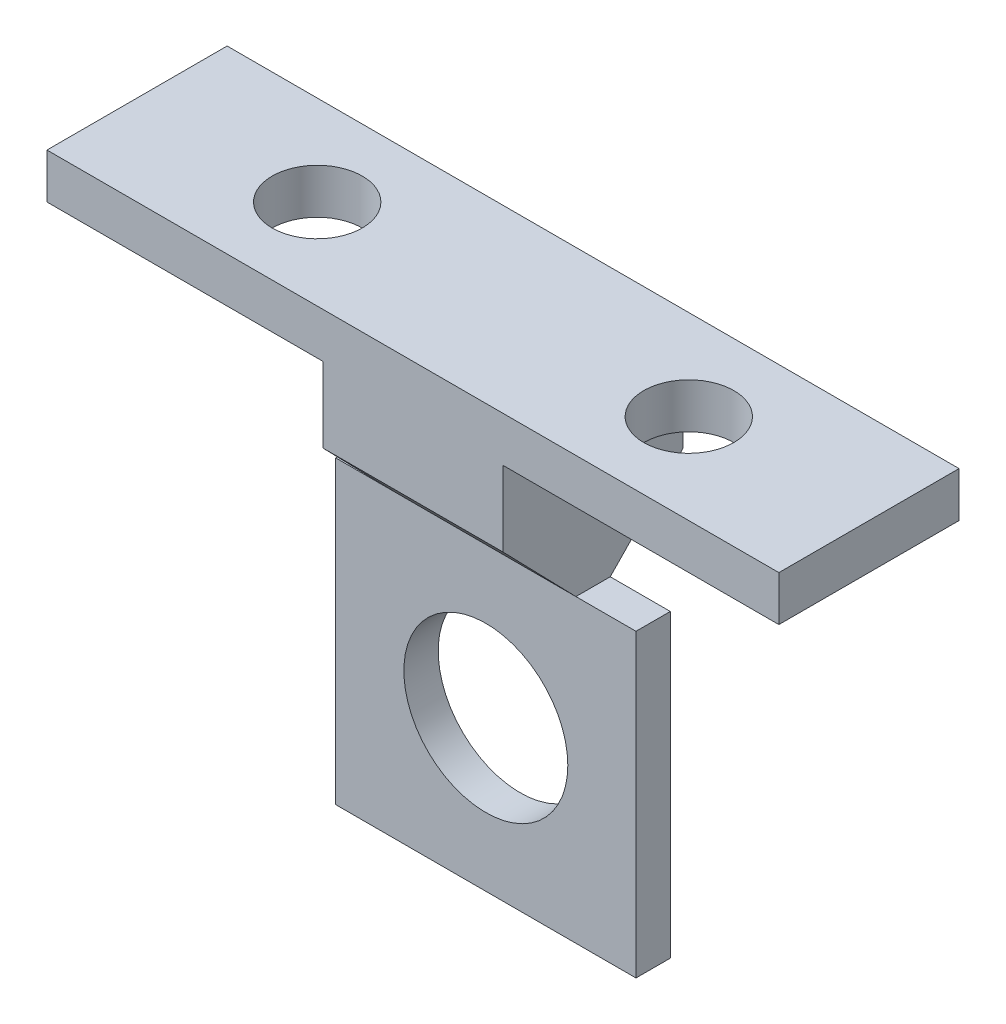
ISO-10303-21;
HEADER;
FILE_DESCRIPTION(('STEP AP214'),'2;1');
FILE_NAME('part.step','',(''),(''),'','','');
FILE_SCHEMA(('AUTOMOTIVE_DESIGN { 1 0 10303 214 1 1 1 1 }'));
ENDSEC;
DATA;
#1=APPLICATION_CONTEXT('core data for automotive mechanical design processes');
#2=APPLICATION_PROTOCOL_DEFINITION('international standard','automotive_design',2000,#1);
#3=PRODUCT_CONTEXT('',#1,'mechanical');
#4=PRODUCT('Part','Part','',(#3));
#5=PRODUCT_RELATED_PRODUCT_CATEGORY('part','',(#4));
#6=PRODUCT_DEFINITION_FORMATION('','',#4);
#7=PRODUCT_DEFINITION_CONTEXT('part definition',#1,'design');
#8=PRODUCT_DEFINITION('design','',#6,#7);
#9=PRODUCT_DEFINITION_SHAPE('','',#8);
#10=(LENGTH_UNIT() NAMED_UNIT(*) SI_UNIT(.MILLI.,.METRE.));
#11=(NAMED_UNIT(*) PLANE_ANGLE_UNIT() SI_UNIT($,.RADIAN.));
#12=(NAMED_UNIT(*) SI_UNIT($,.STERADIAN.) SOLID_ANGLE_UNIT());
#13=UNCERTAINTY_MEASURE_WITH_UNIT(LENGTH_MEASURE(1.E-05),#10,'distance_accuracy_value','');
#14=(GEOMETRIC_REPRESENTATION_CONTEXT(3) GLOBAL_UNCERTAINTY_ASSIGNED_CONTEXT((#13)) GLOBAL_UNIT_ASSIGNED_CONTEXT((#10,
#11,#12)) REPRESENTATION_CONTEXT('',''));
#15=CARTESIAN_POINT('',(0.,0.,0.));
#16=DIRECTION('',(0.,0.,1.));
#17=DIRECTION('',(1.,0.,0.));
#18=AXIS2_PLACEMENT_3D('',#15,#16,#17);
#19=CARTESIAN_POINT('',(-33.0408964823714,13.4768329024308,2.286));
#20=DIRECTION('',(0.,1.,0.));
#21=DIRECTION('',(0.,0.,1.));
#22=AXIS2_PLACEMENT_3D('',#19,#20,#21);
#23=PLANE('',#22);
#24=CARTESIAN_POINT('',(-26.6665278123715,13.4768329024308,1.143));
#25=DIRECTION('',(0.,1.,0.));
#26=DIRECTION('',(0.,0.,1.));
#27=AXIS2_PLACEMENT_3D('',#24,#25,#26);
#28=CIRCLE('',#27,2.99999999999999);
#29=CARTESIAN_POINT('',(-26.6665278123715,13.4768329024308,4.14299999999999));
#30=VERTEX_POINT('',#29);
#31=EDGE_CURVE('E302',#30,#30,#28,.F.);
#32=ORIENTED_EDGE('',*,*,#31,.F.);
#33=EDGE_LOOP('',(#32));
#34=FACE_BOUND('',#33,.T.);
#35=DIRECTION('',(0.,0.,-1.));
#36=VECTOR('',#35,1.);
#37=CARTESIAN_POINT('',(-33.0408964823714,13.4768329024308,2.286));
#38=LINE('',#37,#36);
#39=CARTESIAN_POINT('',(-33.0408964823714,13.4768329024311,7.143));
#40=VERTEX_POINT('',#39);
#41=CARTESIAN_POINT('',(-33.0408964823714,13.4768329024311,-4.857));
#42=VERTEX_POINT('',#41);
#43=EDGE_CURVE('E60',#40,#42,#38,.T.);
#44=ORIENTED_EDGE('',*,*,#43,.T.);
#45=DIRECTION('',(-1.,0.,0.));
#46=VECTOR('',#45,1.);
#47=CARTESIAN_POINT('',(-2.29721093551843,13.4768329024311,-4.857));
#48=LINE('',#47,#46);
#49=CARTESIAN_POINT('',(-14.6665278123714,13.4768329024311,-4.857));
#50=VERTEX_POINT('',#49);
#51=EDGE_CURVE('E202',#50,#42,#48,.T.);
#52=ORIENTED_EDGE('',*,*,#51,.F.);
#53=DIRECTION('',(0.,0.,-1.));
#54=VECTOR('',#53,1.);
#55=CARTESIAN_POINT('',(-14.6665278123714,13.4768329024308,2.286));
#56=LINE('',#55,#54);
#57=CARTESIAN_POINT('',(-14.6665278123714,13.4768329024311,7.143));
#58=VERTEX_POINT('',#57);
#59=EDGE_CURVE('E229',#58,#50,#56,.T.);
#60=ORIENTED_EDGE('',*,*,#59,.F.);
#61=DIRECTION('',(-1.,0.,0.));
#62=VECTOR('',#61,1.);
#63=CARTESIAN_POINT('',(-2.29721093551843,13.4768329024311,7.143));
#64=LINE('',#63,#62);
#65=EDGE_CURVE('E199',#58,#40,#64,.T.);
#66=ORIENTED_EDGE('',*,*,#65,.T.);
#67=EDGE_LOOP('',(#44,#52,#60,#66));
#68=FACE_BOUND('',#67,.T.);
#69=ADVANCED_FACE('F37',(#34,#68),#23,.F.);
#70=CARTESIAN_POINT('',(-51.4152651523715,13.4768329024308,1.143));
#71=DIRECTION('',(0.,1.,0.));
#72=DIRECTION('',(0.,0.,1.));
#73=AXIS2_PLACEMENT_3D('',#70,#71,#72);
#74=CIRCLE('',#73,3.);
#75=CARTESIAN_POINT('',(-51.4152651523715,13.4768329024308,4.143));
#76=VERTEX_POINT('',#75);
#77=EDGE_CURVE('E307',#76,#76,#74,.F.);
#78=ORIENTED_EDGE('',*,*,#77,.F.);
#79=EDGE_LOOP('',(#78));
#80=FACE_BOUND('',#79,.T.);
#81=DIRECTION('',(0.,0.,-1.));
#82=VECTOR('',#81,1.);
#83=CARTESIAN_POINT('',(-45.0408964823714,13.4768329024308,2.286));
#84=LINE('',#83,#82);
#85=CARTESIAN_POINT('',(-45.0408964823714,13.4768329024311,7.143));
#86=VERTEX_POINT('',#85);
#87=CARTESIAN_POINT('',(-45.0408964823714,13.4768329024311,-4.857));
#88=VERTEX_POINT('',#87);
#89=EDGE_CURVE('E46',#86,#88,#84,.T.);
#90=ORIENTED_EDGE('',*,*,#89,.F.);
#91=CARTESIAN_POINT('',(-63.4152651523715,13.4768329024311,7.143));
#92=VERTEX_POINT('',#91);
#93=EDGE_CURVE('E201',#86,#92,#64,.T.);
#94=ORIENTED_EDGE('',*,*,#93,.T.);
#95=DIRECTION('',(0.,0.,-1.));
#96=VECTOR('',#95,1.);
#97=CARTESIAN_POINT('',(-63.4152651523715,13.4768329024308,2.286));
#98=LINE('',#97,#96);
#99=CARTESIAN_POINT('',(-63.4152651523715,13.4768329024311,-4.857));
#100=VERTEX_POINT('',#99);
#101=EDGE_CURVE('E11',#92,#100,#98,.T.);
#102=ORIENTED_EDGE('',*,*,#101,.T.);
#103=EDGE_CURVE('E193',#88,#100,#48,.T.);
#104=ORIENTED_EDGE('',*,*,#103,.F.);
#105=EDGE_LOOP('',(#90,#94,#102,#104));
#106=FACE_BOUND('',#105,.T.);
#107=ADVANCED_FACE('F338',(#80,#106),#23,.F.);
#108=CARTESIAN_POINT('',(-63.4152651523714,16.4768329024308,2.286));
#109=DIRECTION('',(1.,0.,0.));
#110=DIRECTION('',(0.,1.,0.));
#111=AXIS2_PLACEMENT_3D('',#108,#109,#110);
#112=PLANE('',#111);
#113=DIRECTION('',(0.,0.,-1.));
#114=VECTOR('',#113,1.);
#115=CARTESIAN_POINT('',(-63.4152651523714,16.4768329024308,2.286));
#116=LINE('',#115,#114);
#117=CARTESIAN_POINT('',(-63.4152651523715,16.4768329024311,7.143));
#118=VERTEX_POINT('',#117);
#119=CARTESIAN_POINT('',(-63.4152651523715,16.4768329024311,-4.857));
#120=VERTEX_POINT('',#119);
#121=EDGE_CURVE('E216',#118,#120,#116,.T.);
#122=ORIENTED_EDGE('',*,*,#121,.T.);
#123=DIRECTION('',(0.,-1.,0.));
#124=VECTOR('',#123,1.);
#125=CARTESIAN_POINT('',(-63.4152651523715,16.4768329024311,-4.857));
#126=LINE('',#125,#124);
#127=EDGE_CURVE('E179',#120,#100,#126,.T.);
#128=ORIENTED_EDGE('',*,*,#127,.T.);
#129=ORIENTED_EDGE('',*,*,#101,.F.);
#130=DIRECTION('',(0.,1.,0.));
#131=VECTOR('',#130,1.);
#132=CARTESIAN_POINT('',(-63.4152651523715,16.4768329024311,7.143));
#133=LINE('',#132,#131);
#134=EDGE_CURVE('E190',#92,#118,#133,.T.);
#135=ORIENTED_EDGE('',*,*,#134,.T.);
#136=EDGE_LOOP('',(#122,#128,#129,#135));
#137=FACE_BOUND('',#136,.T.);
#138=ADVANCED_FACE('F39',(#137),#112,.F.);
#139=CARTESIAN_POINT('',(-45.0408964823714,8.47683290243078,2.286));
#140=DIRECTION('',(1.,0.,0.));
#141=DIRECTION('',(0.,0.,-1.));
#142=AXIS2_PLACEMENT_3D('',#139,#140,#141);
#143=PLANE('',#142);
#144=ORIENTED_EDGE('',*,*,#89,.T.);
#145=DIRECTION('',(0.,-1.,0.));
#146=VECTOR('',#145,1.);
#147=CARTESIAN_POINT('',(-45.0408964823714,13.4768329024311,-4.857));
#148=LINE('',#147,#146);
#149=CARTESIAN_POINT('',(-45.0408964823714,8.47683290243107,-4.857));
#150=VERTEX_POINT('',#149);
#151=EDGE_CURVE('E165',#88,#150,#148,.T.);
#152=ORIENTED_EDGE('',*,*,#151,.T.);
#153=DIRECTION('',(0.,-0.71728962347272,0.696775140241358));
#154=VECTOR('',#153,1.);
#155=CARTESIAN_POINT('',(-45.0408964823714,8.47683290243107,-4.857));
#156=LINE('',#155,#154);
#157=CARTESIAN_POINT('',(-45.0408964823714,3.47683290243076,0.));
#158=VERTEX_POINT('',#157);
#159=EDGE_CURVE('E297',#150,#158,#156,.T.);
#160=ORIENTED_EDGE('',*,*,#159,.T.);
#161=DIRECTION('',(0.,0.,-1.));
#162=VECTOR('',#161,1.);
#163=CARTESIAN_POINT('',(-45.0408964823714,3.47683290243078,2.286));
#164=LINE('',#163,#162);
#165=CARTESIAN_POINT('',(-45.0408964823714,3.47683290243078,2.286));
#166=VERTEX_POINT('',#165);
#167=EDGE_CURVE('E246',#166,#158,#164,.T.);
#168=ORIENTED_EDGE('',*,*,#167,.F.);
#169=DIRECTION('',(0.,0.71728962347272,0.696775140241358));
#170=VECTOR('',#169,1.);
#171=CARTESIAN_POINT('',(-45.0408964823714,3.47683290243076,2.286));
#172=LINE('',#171,#170);
#173=CARTESIAN_POINT('',(-45.0408964823714,8.47683290243107,7.143));
#174=VERTEX_POINT('',#173);
#175=EDGE_CURVE('E173',#166,#174,#172,.T.);
#176=ORIENTED_EDGE('',*,*,#175,.T.);
#177=DIRECTION('',(0.,1.,0.));
#178=VECTOR('',#177,1.);
#179=CARTESIAN_POINT('',(-45.0408964823714,8.47683290243107,7.143));
#180=LINE('',#179,#178);
#181=EDGE_CURVE('E147',#174,#86,#180,.T.);
#182=ORIENTED_EDGE('',*,*,#181,.T.);
#183=EDGE_LOOP('',(#144,#152,#160,#168,#176,#182));
#184=FACE_BOUND('',#183,.T.);
#185=ADVANCED_FACE('F296',(#184),#143,.F.);
#186=CARTESIAN_POINT('',(-45.0408964823714,3.47683290243078,2.286));
#187=DIRECTION('',(0.,-1.,0.));
#188=DIRECTION('',(1.,0.,0.));
#189=AXIS2_PLACEMENT_3D('',#186,#187,#188);
#190=PLANE('',#189);
#191=DIRECTION('',(-1.,0.,0.));
#192=VECTOR('',#191,1.);
#193=CARTESIAN_POINT('',(-45.0408964823714,3.47683290243078,0.));
#194=LINE('',#193,#192);
#195=CARTESIAN_POINT('',(-49.0408964823714,3.47683290243077,0.));
#196=VERTEX_POINT('',#195);
#197=EDGE_CURVE('E187',#158,#196,#194,.T.);
#198=ORIENTED_EDGE('',*,*,#197,.T.);
#199=DIRECTION('',(0.,0.,-1.));
#200=VECTOR('',#199,1.);
#201=CARTESIAN_POINT('',(-49.0408964823714,3.47683290243077,2.286));
#202=LINE('',#201,#200);
#203=CARTESIAN_POINT('',(-49.0408964823714,3.47683290243077,2.286));
#204=VERTEX_POINT('',#203);
#205=EDGE_CURVE('E243',#204,#196,#202,.T.);
#206=ORIENTED_EDGE('',*,*,#205,.F.);
#207=DIRECTION('',(-1.,0.,0.));
#208=VECTOR('',#207,1.);
#209=CARTESIAN_POINT('',(-45.0408964823714,3.47683290243078,2.286));
#210=LINE('',#209,#208);
#211=EDGE_CURVE('E205',#166,#204,#210,.T.);
#212=ORIENTED_EDGE('',*,*,#211,.F.);
#213=ORIENTED_EDGE('',*,*,#167,.T.);
#214=EDGE_LOOP('',(#198,#206,#212,#213));
#215=FACE_BOUND('',#214,.T.);
#216=ADVANCED_FACE('F253',(#215),#190,.F.);
#217=CARTESIAN_POINT('',(-49.0408964823714,3.47683290243077,2.286));
#218=DIRECTION('',(1.,0.,0.));
#219=DIRECTION('',(0.,1.,0.));
#220=AXIS2_PLACEMENT_3D('',#217,#218,#219);
#221=PLANE('',#220);
#222=DIRECTION('',(0.,-1.,0.));
#223=VECTOR('',#222,1.);
#224=CARTESIAN_POINT('',(-49.0408964823714,3.47683290243077,0.));
#225=LINE('',#224,#223);
#226=CARTESIAN_POINT('',(-49.0408964823714,-16.5231670975692,0.));
#227=VERTEX_POINT('',#226);
#228=EDGE_CURVE('E218',#196,#227,#225,.T.);
#229=ORIENTED_EDGE('',*,*,#228,.T.);
#230=DIRECTION('',(0.,0.,-1.));
#231=VECTOR('',#230,1.);
#232=CARTESIAN_POINT('',(-49.0408964823714,-16.5231670975692,2.286));
#233=LINE('',#232,#231);
#234=CARTESIAN_POINT('',(-49.0408964823714,-16.5231670975692,2.286));
#235=VERTEX_POINT('',#234);
#236=EDGE_CURVE('E240',#235,#227,#233,.T.);
#237=ORIENTED_EDGE('',*,*,#236,.F.);
#238=DIRECTION('',(0.,-1.,0.));
#239=VECTOR('',#238,1.);
#240=CARTESIAN_POINT('',(-49.0408964823714,3.47683290243077,2.286));
#241=LINE('',#240,#239);
#242=EDGE_CURVE('E207',#204,#235,#241,.T.);
#243=ORIENTED_EDGE('',*,*,#242,.F.);
#244=ORIENTED_EDGE('',*,*,#205,.T.);
#245=EDGE_LOOP('',(#229,#237,#243,#244));
#246=FACE_BOUND('',#245,.T.);
#247=ADVANCED_FACE('F264',(#246),#221,.F.);
#248=CARTESIAN_POINT('',(-49.0408964823714,-16.5231670975692,2.286));
#249=DIRECTION('',(0.,1.,0.));
#250=DIRECTION('',(-1.,0.,0.));
#251=AXIS2_PLACEMENT_3D('',#248,#249,#250);
#252=PLANE('',#251);
#253=DIRECTION('',(1.,0.,0.));
#254=VECTOR('',#253,1.);
#255=CARTESIAN_POINT('',(-49.0408964823714,-16.5231670975692,0.));
#256=LINE('',#255,#254);
#257=CARTESIAN_POINT('',(-29.0408964823714,-16.5231670975692,0.));
#258=VERTEX_POINT('',#257);
#259=EDGE_CURVE('E220',#227,#258,#256,.T.);
#260=ORIENTED_EDGE('',*,*,#259,.T.);
#261=DIRECTION('',(0.,0.,-1.));
#262=VECTOR('',#261,1.);
#263=CARTESIAN_POINT('',(-29.0408964823714,-16.5231670975692,2.286));
#264=LINE('',#263,#262);
#265=CARTESIAN_POINT('',(-29.0408964823714,-16.5231670975692,2.286));
#266=VERTEX_POINT('',#265);
#267=EDGE_CURVE('E237',#266,#258,#264,.T.);
#268=ORIENTED_EDGE('',*,*,#267,.F.);
#269=DIRECTION('',(1.,0.,0.));
#270=VECTOR('',#269,1.);
#271=CARTESIAN_POINT('',(-49.0408964823714,-16.5231670975692,2.286));
#272=LINE('',#271,#270);
#273=EDGE_CURVE('E210',#235,#266,#272,.T.);
#274=ORIENTED_EDGE('',*,*,#273,.F.);
#275=ORIENTED_EDGE('',*,*,#236,.T.);
#276=EDGE_LOOP('',(#260,#268,#274,#275));
#277=FACE_BOUND('',#276,.T.);
#278=ADVANCED_FACE('F268',(#277),#252,.F.);
#279=CARTESIAN_POINT('',(-29.0408964823714,3.47683290243078,2.286));
#280=DIRECTION('',(-1.,0.,0.));
#281=DIRECTION('',(0.,0.,1.));
#282=AXIS2_PLACEMENT_3D('',#279,#280,#281);
#283=PLANE('',#282);
#284=DIRECTION('',(0.,1.,0.));
#285=VECTOR('',#284,1.);
#286=CARTESIAN_POINT('',(-29.0408964823714,3.47683290243078,0.));
#287=LINE('',#286,#285);
#288=CARTESIAN_POINT('',(-29.0408964823714,3.47683290243078,0.));
#289=VERTEX_POINT('',#288);
#290=EDGE_CURVE('E222',#258,#289,#287,.T.);
#291=ORIENTED_EDGE('',*,*,#290,.T.);
#292=DIRECTION('',(0.,0.,-1.));
#293=VECTOR('',#292,1.);
#294=CARTESIAN_POINT('',(-29.0408964823714,3.47683290243078,2.286));
#295=LINE('',#294,#293);
#296=CARTESIAN_POINT('',(-29.0408964823714,3.47683290243078,2.286));
#297=VERTEX_POINT('',#296);
#298=EDGE_CURVE('E234',#297,#289,#295,.T.);
#299=ORIENTED_EDGE('',*,*,#298,.F.);
#300=DIRECTION('',(0.,1.,0.));
#301=VECTOR('',#300,1.);
#302=CARTESIAN_POINT('',(-29.0408964823714,3.47683290243078,2.286));
#303=LINE('',#302,#301);
#304=EDGE_CURVE('E212',#266,#297,#303,.T.);
#305=ORIENTED_EDGE('',*,*,#304,.F.);
#306=ORIENTED_EDGE('',*,*,#267,.T.);
#307=EDGE_LOOP('',(#291,#299,#305,#306));
#308=FACE_BOUND('',#307,.T.);
#309=ADVANCED_FACE('F352',(#308),#283,.F.);
#310=CARTESIAN_POINT('',(-29.0408964823714,3.47683290243078,2.286));
#311=DIRECTION('',(0.,-1.,0.));
#312=DIRECTION('',(1.,0.,0.));
#313=AXIS2_PLACEMENT_3D('',#310,#311,#312);
#314=PLANE('',#313);
#315=DIRECTION('',(-1.,0.,0.));
#316=VECTOR('',#315,1.);
#317=CARTESIAN_POINT('',(-29.0408964823714,3.47683290243078,0.));
#318=LINE('',#317,#316);
#319=CARTESIAN_POINT('',(-33.0408964823714,3.47683290243076,0.));
#320=VERTEX_POINT('',#319);
#321=EDGE_CURVE('E208',#289,#320,#318,.T.);
#322=ORIENTED_EDGE('',*,*,#321,.T.);
#323=DIRECTION('',(0.,0.,-1.));
#324=VECTOR('',#323,1.);
#325=CARTESIAN_POINT('',(-33.0408964823714,3.47683290243078,2.286));
#326=LINE('',#325,#324);
#327=CARTESIAN_POINT('',(-33.0408964823714,3.47683290243078,2.286));
#328=VERTEX_POINT('',#327);
#329=EDGE_CURVE('E232',#328,#320,#326,.T.);
#330=ORIENTED_EDGE('',*,*,#329,.F.);
#331=DIRECTION('',(-1.,0.,0.));
#332=VECTOR('',#331,1.);
#333=CARTESIAN_POINT('',(-29.0408964823714,3.47683290243078,2.286));
#334=LINE('',#333,#332);
#335=EDGE_CURVE('E214',#297,#328,#334,.T.);
#336=ORIENTED_EDGE('',*,*,#335,.F.);
#337=ORIENTED_EDGE('',*,*,#298,.T.);
#338=EDGE_LOOP('',(#322,#330,#336,#337));
#339=FACE_BOUND('',#338,.T.);
#340=ADVANCED_FACE('F277',(#339),#314,.F.);
#341=CARTESIAN_POINT('',(-33.0408964823714,13.4768329024308,2.286));
#342=DIRECTION('',(-1.,0.,0.));
#343=DIRECTION('',(0.,0.,1.));
#344=AXIS2_PLACEMENT_3D('',#341,#342,#343);
#345=PLANE('',#344);
#346=ORIENTED_EDGE('',*,*,#329,.T.);
#347=DIRECTION('',(0.,0.71728962347272,-0.696775140241358));
#348=VECTOR('',#347,1.);
#349=CARTESIAN_POINT('',(-33.0408964823714,8.47683290243107,-4.857));
#350=LINE('',#349,#348);
#351=CARTESIAN_POINT('',(-33.0408964823714,8.47683290243107,-4.857));
#352=VERTEX_POINT('',#351);
#353=EDGE_CURVE('E158',#320,#352,#350,.T.);
#354=ORIENTED_EDGE('',*,*,#353,.T.);
#355=DIRECTION('',(0.,1.,0.));
#356=VECTOR('',#355,1.);
#357=CARTESIAN_POINT('',(-33.0408964823714,13.4768329024311,-4.857));
#358=LINE('',#357,#356);
#359=EDGE_CURVE('E151',#352,#42,#358,.T.);
#360=ORIENTED_EDGE('',*,*,#359,.T.);
#361=ORIENTED_EDGE('',*,*,#43,.F.);
#362=DIRECTION('',(0.,-1.,0.));
#363=VECTOR('',#362,1.);
#364=CARTESIAN_POINT('',(-33.0408964823714,8.47683290243107,7.143));
#365=LINE('',#364,#363);
#366=CARTESIAN_POINT('',(-33.0408964823714,8.47683290243107,7.143));
#367=VERTEX_POINT('',#366);
#368=EDGE_CURVE('E145',#40,#367,#365,.T.);
#369=ORIENTED_EDGE('',*,*,#368,.T.);
#370=DIRECTION('',(0.,-0.71728962347272,-0.696775140241358));
#371=VECTOR('',#370,1.);
#372=CARTESIAN_POINT('',(-33.0408964823714,3.47683290243076,2.286));
#373=LINE('',#372,#371);
#374=EDGE_CURVE('E155',#367,#328,#373,.T.);
#375=ORIENTED_EDGE('',*,*,#374,.T.);
#376=EDGE_LOOP('',(#346,#354,#360,#361,#369,#375));
#377=FACE_BOUND('',#376,.T.);
#378=ADVANCED_FACE('F160',(#377),#345,.F.);
#379=CARTESIAN_POINT('',(-14.6665278123714,16.4768329024308,2.286));
#380=DIRECTION('',(-1.,0.,0.));
#381=DIRECTION('',(0.,-1.,0.));
#382=AXIS2_PLACEMENT_3D('',#379,#380,#381);
#383=PLANE('',#382);
#384=ORIENTED_EDGE('',*,*,#59,.T.);
#385=DIRECTION('',(0.,1.,0.));
#386=VECTOR('',#385,1.);
#387=CARTESIAN_POINT('',(-14.6665278123714,16.476832902431,-4.857));
#388=LINE('',#387,#386);
#389=CARTESIAN_POINT('',(-14.6665278123714,16.4768329024311,-4.857));
#390=VERTEX_POINT('',#389);
#391=EDGE_CURVE('E183',#50,#390,#388,.T.);
#392=ORIENTED_EDGE('',*,*,#391,.T.);
#393=DIRECTION('',(0.,0.,-1.));
#394=VECTOR('',#393,1.);
#395=CARTESIAN_POINT('',(-14.6665278123714,16.4768329024308,2.286));
#396=LINE('',#395,#394);
#397=CARTESIAN_POINT('',(-14.6665278123714,16.4768329024311,7.143));
#398=VERTEX_POINT('',#397);
#399=EDGE_CURVE('E227',#398,#390,#396,.T.);
#400=ORIENTED_EDGE('',*,*,#399,.F.);
#401=DIRECTION('',(0.,-1.,0.));
#402=VECTOR('',#401,1.);
#403=CARTESIAN_POINT('',(-14.6665278123714,16.476832902431,7.143));
#404=LINE('',#403,#402);
#405=EDGE_CURVE('E180',#398,#58,#404,.T.);
#406=ORIENTED_EDGE('',*,*,#405,.T.);
#407=EDGE_LOOP('',(#384,#392,#400,#406));
#408=FACE_BOUND('',#407,.T.);
#409=ADVANCED_FACE('F319',(#408),#383,.F.);
#410=CARTESIAN_POINT('',(-14.6665278123714,16.4768329024308,2.286));
#411=DIRECTION('',(0.,-1.,0.));
#412=DIRECTION('',(0.,0.,-1.));
#413=AXIS2_PLACEMENT_3D('',#410,#411,#412);
#414=PLANE('',#413);
#415=CARTESIAN_POINT('',(-26.6665278123715,16.4768329024308,1.143));
#416=DIRECTION('',(0.,1.,0.));
#417=DIRECTION('',(0.,0.,1.));
#418=AXIS2_PLACEMENT_3D('',#415,#416,#417);
#419=CIRCLE('',#418,2.99999999999999);
#420=CARTESIAN_POINT('',(-26.6665278123715,16.4768329024308,4.14299999999999));
#421=VERTEX_POINT('',#420);
#422=EDGE_CURVE('E306',#421,#421,#419,.T.);
#423=ORIENTED_EDGE('',*,*,#422,.F.);
#424=EDGE_LOOP('',(#423));
#425=FACE_BOUND('',#424,.T.);
#426=CARTESIAN_POINT('',(-51.4152651523715,16.4768329024308,1.143));
#427=DIRECTION('',(0.,1.,0.));
#428=DIRECTION('',(0.,0.,1.));
#429=AXIS2_PLACEMENT_3D('',#426,#427,#428);
#430=CIRCLE('',#429,3.);
#431=CARTESIAN_POINT('',(-51.4152651523715,16.4768329024308,4.143));
#432=VERTEX_POINT('',#431);
#433=EDGE_CURVE('E303',#432,#432,#430,.T.);
#434=ORIENTED_EDGE('',*,*,#433,.F.);
#435=EDGE_LOOP('',(#434));
#436=FACE_BOUND('',#435,.T.);
#437=ORIENTED_EDGE('',*,*,#399,.T.);
#438=DIRECTION('',(-1.,0.,0.));
#439=VECTOR('',#438,1.);
#440=CARTESIAN_POINT('',(-2.29721093551843,16.4768329024311,-4.857));
#441=LINE('',#440,#439);
#442=EDGE_CURVE('E184',#390,#120,#441,.T.);
#443=ORIENTED_EDGE('',*,*,#442,.T.);
#444=ORIENTED_EDGE('',*,*,#121,.F.);
#445=DIRECTION('',(-1.,0.,0.));
#446=VECTOR('',#445,1.);
#447=CARTESIAN_POINT('',(-2.29721093551843,16.4768329024311,7.143));
#448=LINE('',#447,#446);
#449=EDGE_CURVE('E196',#398,#118,#448,.T.);
#450=ORIENTED_EDGE('',*,*,#449,.F.);
#451=EDGE_LOOP('',(#437,#443,#444,#450));
#452=FACE_BOUND('',#451,.T.);
#453=ADVANCED_FACE('F291',(#425,#436,#452),#414,.F.);
#454=CARTESIAN_POINT('',(0.,0.,2.286));
#455=DIRECTION('',(0.,0.,1.));
#456=DIRECTION('',(1.,0.,0.));
#457=AXIS2_PLACEMENT_3D('',#454,#455,#456);
#458=PLANE('',#457);
#459=CARTESIAN_POINT('',(-39.0408964823714,-6.52316709756922,2.286));
#460=DIRECTION('',(0.,0.,1.));
#461=DIRECTION('',(1.,0.,0.));
#462=AXIS2_PLACEMENT_3D('',#459,#460,#461);
#463=CIRCLE('',#462,5.46);
#464=CARTESIAN_POINT('',(-33.5808964823714,-6.52316709756922,2.286));
#465=VERTEX_POINT('',#464);
#466=EDGE_CURVE('E163',#465,#465,#463,.T.);
#467=ORIENTED_EDGE('',*,*,#466,.F.);
#468=EDGE_LOOP('',(#467));
#469=FACE_BOUND('',#468,.T.);
#470=DIRECTION('',(1.,0.,0.));
#471=VECTOR('',#470,1.);
#472=CARTESIAN_POINT('',(-60.6613958341849,3.47683290243076,2.286));
#473=LINE('',#472,#471);
#474=EDGE_CURVE('E150',#166,#328,#473,.T.);
#475=ORIENTED_EDGE('',*,*,#474,.F.);
#476=ORIENTED_EDGE('',*,*,#211,.T.);
#477=ORIENTED_EDGE('',*,*,#242,.T.);
#478=ORIENTED_EDGE('',*,*,#273,.T.);
#479=ORIENTED_EDGE('',*,*,#304,.T.);
#480=ORIENTED_EDGE('',*,*,#335,.T.);
#481=EDGE_LOOP('',(#475,#476,#477,#478,#479,#480));
#482=FACE_BOUND('',#481,.T.);
#483=ADVANCED_FACE('F272',(#469,#482),#458,.T.);
#484=CARTESIAN_POINT('',(0.,0.,0.));
#485=DIRECTION('',(0.,0.,1.));
#486=DIRECTION('',(1.,0.,0.));
#487=AXIS2_PLACEMENT_3D('',#484,#485,#486);
#488=PLANE('',#487);
#489=CARTESIAN_POINT('',(-39.0408964823714,-6.52316709756922,0.));
#490=DIRECTION('',(0.,0.,1.));
#491=DIRECTION('',(1.,0.,0.));
#492=AXIS2_PLACEMENT_3D('',#489,#490,#491);
#493=CIRCLE('',#492,5.46);
#494=CARTESIAN_POINT('',(-33.5808964823714,-6.52316709756922,0.));
#495=VERTEX_POINT('',#494);
#496=EDGE_CURVE('E41',#495,#495,#493,.T.);
#497=ORIENTED_EDGE('',*,*,#496,.T.);
#498=EDGE_LOOP('',(#497));
#499=FACE_BOUND('',#498,.T.);
#500=ORIENTED_EDGE('',*,*,#197,.F.);
#501=DIRECTION('',(1.,0.,0.));
#502=VECTOR('',#501,1.);
#503=CARTESIAN_POINT('',(-60.6613958341849,3.47683290243076,0.));
#504=LINE('',#503,#502);
#505=EDGE_CURVE('E174',#158,#320,#504,.T.);
#506=ORIENTED_EDGE('',*,*,#505,.T.);
#507=ORIENTED_EDGE('',*,*,#321,.F.);
#508=ORIENTED_EDGE('',*,*,#290,.F.);
#509=ORIENTED_EDGE('',*,*,#259,.F.);
#510=ORIENTED_EDGE('',*,*,#228,.F.);
#511=EDGE_LOOP('',(#500,#506,#507,#508,#509,#510));
#512=FACE_BOUND('',#511,.T.);
#513=ADVANCED_FACE('F257',(#499,#512),#488,.F.);
#514=CARTESIAN_POINT('',(-2.29721093551843,16.4768329024311,-4.857));
#515=DIRECTION('',(0.,0.,-1.));
#516=DIRECTION('',(-1.,0.,0.));
#517=AXIS2_PLACEMENT_3D('',#514,#515,#516);
#518=PLANE('',#517);
#519=ORIENTED_EDGE('',*,*,#391,.F.);
#520=ORIENTED_EDGE('',*,*,#51,.T.);
#521=ORIENTED_EDGE('',*,*,#359,.F.);
#522=DIRECTION('',(1.,0.,0.));
#523=VECTOR('',#522,1.);
#524=CARTESIAN_POINT('',(-60.6613958341849,8.47683290243107,-4.857));
#525=LINE('',#524,#523);
#526=EDGE_CURVE('E171',#150,#352,#525,.T.);
#527=ORIENTED_EDGE('',*,*,#526,.F.);
#528=ORIENTED_EDGE('',*,*,#151,.F.);
#529=ORIENTED_EDGE('',*,*,#103,.T.);
#530=ORIENTED_EDGE('',*,*,#127,.F.);
#531=ORIENTED_EDGE('',*,*,#442,.F.);
#532=EDGE_LOOP('',(#519,#520,#521,#527,#528,#529,#530,#531));
#533=FACE_BOUND('',#532,.T.);
#534=ADVANCED_FACE('F283',(#533),#518,.T.);
#535=CARTESIAN_POINT('',(-2.29721093551843,16.4768329024311,7.143));
#536=DIRECTION('',(0.,0.,1.));
#537=DIRECTION('',(1.,0.,0.));
#538=AXIS2_PLACEMENT_3D('',#535,#536,#537);
#539=PLANE('',#538);
#540=ORIENTED_EDGE('',*,*,#405,.F.);
#541=ORIENTED_EDGE('',*,*,#449,.T.);
#542=ORIENTED_EDGE('',*,*,#134,.F.);
#543=ORIENTED_EDGE('',*,*,#93,.F.);
#544=ORIENTED_EDGE('',*,*,#181,.F.);
#545=DIRECTION('',(1.,0.,0.));
#546=VECTOR('',#545,1.);
#547=CARTESIAN_POINT('',(-60.6613958341849,8.47683290243107,7.143));
#548=LINE('',#547,#546);
#549=EDGE_CURVE('E140',#174,#367,#548,.T.);
#550=ORIENTED_EDGE('',*,*,#549,.T.);
#551=ORIENTED_EDGE('',*,*,#368,.F.);
#552=ORIENTED_EDGE('',*,*,#65,.F.);
#553=EDGE_LOOP('',(#540,#541,#542,#543,#544,#550,#551,#552));
#554=FACE_BOUND('',#553,.T.);
#555=ADVANCED_FACE('F143',(#554),#539,.T.);
#556=CARTESIAN_POINT('',(-60.6613958341849,3.47683290243076,2.286));
#557=DIRECTION('',(0.,-0.696775140241358,0.71728962347272));
#558=DIRECTION('',(0.,-0.71728962347272,-0.696775140241358));
#559=AXIS2_PLACEMENT_3D('',#556,#557,#558);
#560=PLANE('',#559);
#561=ORIENTED_EDGE('',*,*,#175,.F.);
#562=ORIENTED_EDGE('',*,*,#474,.T.);
#563=ORIENTED_EDGE('',*,*,#374,.F.);
#564=ORIENTED_EDGE('',*,*,#549,.F.);
#565=EDGE_LOOP('',(#561,#562,#563,#564));
#566=FACE_BOUND('',#565,.T.);
#567=ADVANCED_FACE('F156',(#566),#560,.T.);
#568=CARTESIAN_POINT('',(-60.6613958341849,8.47683290243107,-4.857));
#569=DIRECTION('',(0.,-0.696775140241358,-0.71728962347272));
#570=DIRECTION('',(0.,0.71728962347272,-0.696775140241358));
#571=AXIS2_PLACEMENT_3D('',#568,#569,#570);
#572=PLANE('',#571);
#573=ORIENTED_EDGE('',*,*,#159,.F.);
#574=ORIENTED_EDGE('',*,*,#526,.T.);
#575=ORIENTED_EDGE('',*,*,#353,.F.);
#576=ORIENTED_EDGE('',*,*,#505,.F.);
#577=EDGE_LOOP('',(#573,#574,#575,#576));
#578=FACE_BOUND('',#577,.T.);
#579=ADVANCED_FACE('F334',(#578),#572,.T.);
#580=CARTESIAN_POINT('',(-39.0408964823714,-6.52316709756922,-4.857));
#581=DIRECTION('',(0.,0.,1.));
#582=DIRECTION('',(1.,0.,0.));
#583=AXIS2_PLACEMENT_3D('',#580,#581,#582);
#584=CYLINDRICAL_SURFACE('',#583,5.46);
#585=ORIENTED_EDGE('',*,*,#466,.T.);
#586=EDGE_LOOP('',(#585));
#587=FACE_BOUND('',#586,.T.);
#588=ORIENTED_EDGE('',*,*,#496,.F.);
#589=EDGE_LOOP('',(#588));
#590=FACE_BOUND('',#589,.T.);
#591=ADVANCED_FACE('F325',(#587,#590),#584,.F.);
#592=CARTESIAN_POINT('',(-51.4152651523715,4.9915515281922,1.143));
#593=DIRECTION('',(0.,1.,0.));
#594=DIRECTION('',(0.,0.,1.));
#595=AXIS2_PLACEMENT_3D('',#592,#593,#594);
#596=CYLINDRICAL_SURFACE('',#595,3.);
#597=ORIENTED_EDGE('',*,*,#77,.T.);
#598=EDGE_LOOP('',(#597));
#599=FACE_BOUND('',#598,.T.);
#600=ORIENTED_EDGE('',*,*,#433,.T.);
#601=EDGE_LOOP('',(#600));
#602=FACE_BOUND('',#601,.T.);
#603=ADVANCED_FACE('F323',(#599,#602),#596,.F.);
#604=CARTESIAN_POINT('',(-26.6665278123715,4.9915515281922,1.143));
#605=DIRECTION('',(0.,1.,0.));
#606=DIRECTION('',(0.,0.,1.));
#607=AXIS2_PLACEMENT_3D('',#604,#605,#606);
#608=CYLINDRICAL_SURFACE('',#607,2.99999999999999);
#609=ORIENTED_EDGE('',*,*,#31,.T.);
#610=EDGE_LOOP('',(#609));
#611=FACE_BOUND('',#610,.T.);
#612=ORIENTED_EDGE('',*,*,#422,.T.);
#613=EDGE_LOOP('',(#612));
#614=FACE_BOUND('',#613,.T.);
#615=ADVANCED_FACE('F315',(#611,#614),#608,.F.);
#616=CLOSED_SHELL('',(#69,#107,#138,#185,#216,#247,#278,#309,#340,#378,#409,#453,#483,#513,#534,
#555,#567,#579,#591,#603,#615));
#617=MANIFOLD_SOLID_BREP('B2',#616);
#618=ADVANCED_BREP_SHAPE_REPRESENTATION('',(#18,#617),#14);
#619=SHAPE_DEFINITION_REPRESENTATION(#9,#618);
ENDSEC;
END-ISO-10303-21;
